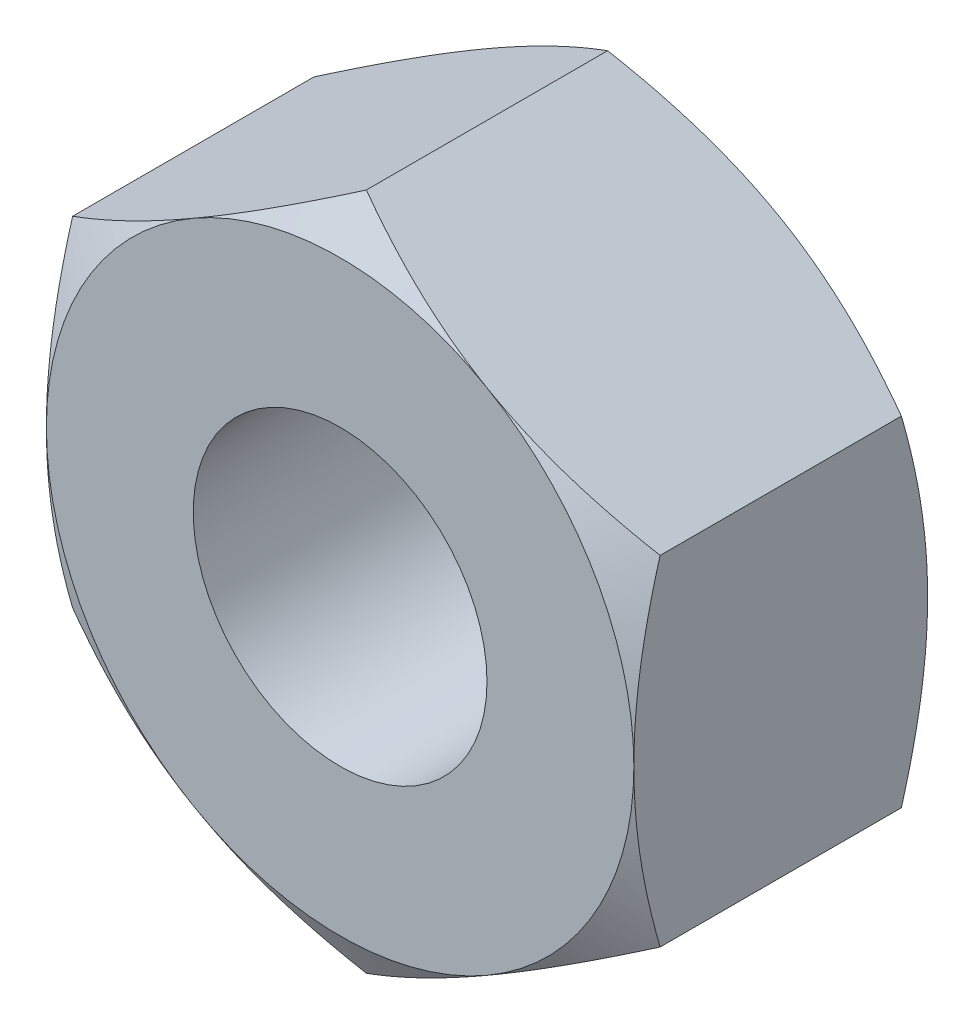
ISO-10303-21;
HEADER;
FILE_DESCRIPTION(('STEP AP214'),'2;1');
FILE_NAME('part.step','',(''),(''),'','','');
FILE_SCHEMA(('AUTOMOTIVE_DESIGN { 1 0 10303 214 1 1 1 1 }'));
ENDSEC;
DATA;
#1=APPLICATION_CONTEXT('core data for automotive mechanical design processes');
#2=APPLICATION_PROTOCOL_DEFINITION('international standard','automotive_design',2000,#1);
#3=PRODUCT_CONTEXT('',#1,'mechanical');
#4=PRODUCT('Part','Part','',(#3));
#5=PRODUCT_RELATED_PRODUCT_CATEGORY('part','',(#4));
#6=PRODUCT_DEFINITION_FORMATION('','',#4);
#7=PRODUCT_DEFINITION_CONTEXT('part definition',#1,'design');
#8=PRODUCT_DEFINITION('design','',#6,#7);
#9=PRODUCT_DEFINITION_SHAPE('','',#8);
#10=(LENGTH_UNIT() NAMED_UNIT(*) SI_UNIT(.MILLI.,.METRE.));
#11=(NAMED_UNIT(*) PLANE_ANGLE_UNIT() SI_UNIT($,.RADIAN.));
#12=(NAMED_UNIT(*) SI_UNIT($,.STERADIAN.) SOLID_ANGLE_UNIT());
#13=UNCERTAINTY_MEASURE_WITH_UNIT(LENGTH_MEASURE(1.E-05),#10,'distance_accuracy_value','');
#14=(GEOMETRIC_REPRESENTATION_CONTEXT(3) GLOBAL_UNCERTAINTY_ASSIGNED_CONTEXT((#13)) GLOBAL_UNIT_ASSIGNED_CONTEXT((#10,
#11,#12)) REPRESENTATION_CONTEXT('',''));
#15=CARTESIAN_POINT('',(0.,0.,0.));
#16=DIRECTION('',(0.,0.,1.));
#17=DIRECTION('',(1.,0.,0.));
#18=AXIS2_PLACEMENT_3D('',#15,#16,#17);
#19=CARTESIAN_POINT('',(0.,2.30940107675851,-2.));
#20=DIRECTION('',(-0.500000000000002,0.866025403784438,0.));
#21=DIRECTION('',(-0.866025403784438,-0.500000000000002,0.));
#22=AXIS2_PLACEMENT_3D('',#19,#20,#21);
#23=PLANE('',#22);
#24=DIRECTION('',(0.,0.,1.));
#25=VECTOR('',#24,1.);
#26=CARTESIAN_POINT('',(-2.,1.15470053837925,-2.));
#27=LINE('',#26,#25);
#28=CARTESIAN_POINT('',(-2.,1.15470053837926,-1.82136720504592));
#29=VERTEX_POINT('',#28);
#30=CARTESIAN_POINT('',(-2.,1.15470053837925,-0.178632794954081));
#31=VERTEX_POINT('',#30);
#32=EDGE_CURVE('E166',#29,#31,#27,.T.);
#33=ORIENTED_EDGE('',*,*,#32,.T.);
#34=CARTESIAN_POINT('',(-2.0002,1.15458506832541,-0.178699466620498));
#35=CARTESIAN_POINT('',(-1.91230873709994,1.20532911262018,-0.149389536100679));
#36=CARTESIAN_POINT('',(-1.82365880552641,1.2565111744778,-0.122732851980466));
#37=CARTESIAN_POINT('',(-1.6448237530022,1.35976164019319,-0.0762024910207205));
#38=CARTESIAN_POINT('',(-1.55463545349496,1.41183187919145,-0.0563452763827787));
#39=CARTESIAN_POINT('',(-1.37537661423669,1.51532701829183,-0.0254334640232521));
#40=CARTESIAN_POINT('',(-1.2863336617737,1.56673599086578,-0.0141731515985308));
#41=CARTESIAN_POINT('',(-1.10782860221496,1.66979593505373,-0.000728662594641722));
#42=CARTESIAN_POINT('',(-1.01836714429604,1.72144653186531,0.00146664504653192));
#43=CARTESIAN_POINT('',(-0.851191646451203,1.81796535054794,-0.00309098933064872));
#44=CARTESIAN_POINT('',(-0.773452629734217,1.86284799277603,-0.00872487468701454));
#45=CARTESIAN_POINT('',(-0.618481085463868,1.95232085557725,-0.0265838952608286));
#46=CARTESIAN_POINT('',(-0.541249094258803,1.99691076648954,-0.0388151360234399));
#47=CARTESIAN_POINT('',(-0.3859578135178,2.08656822922816,-0.0693934368676109));
#48=CARTESIAN_POINT('',(-0.307918186892621,2.13162442866767,-0.0878701670657172));
#49=CARTESIAN_POINT('',(-0.153003134307866,2.221064675979,-0.129805518212858));
#50=CARTESIAN_POINT('',(-0.0761257223768807,2.26544987045196,-0.153254280492315));
#51=CARTESIAN_POINT('',(0.000199999999999366,2.30951654681234,-0.1786994666205));
#52=B_SPLINE_CURVE_WITH_KNOTS('',3,(#34,#35,#36,#37,#38,#39,#40,#41,#42,#43,#44,#45,#46,#47,#48,
#49,#50,#51),.UNSPECIFIED.,.F.,.F.,(4,2,2,2,2,2,2,2,4),(0.,0.31703182469561,0.634825876346564,
0.944753967652636,1.25430138000371,1.52387047293094,1.79368946861028,2.06949491027634,
2.34475850821473),.UNSPECIFIED.);
#53=CARTESIAN_POINT('',(-1.,1.73205080756888,0.));
#54=VERTEX_POINT('',#53);
#55=EDGE_CURVE('E62',#31,#54,#52,.T.);
#56=ORIENTED_EDGE('',*,*,#55,.T.);
#57=CARTESIAN_POINT('',(0.,2.30940107675851,-0.178632794954083));
#58=VERTEX_POINT('',#57);
#59=EDGE_CURVE('E208',#54,#58,#52,.T.);
#60=ORIENTED_EDGE('',*,*,#59,.T.);
#61=DIRECTION('',(0.,0.,1.));
#62=VECTOR('',#61,1.);
#63=CARTESIAN_POINT('',(0.,2.30940107675851,-2.));
#64=LINE('',#63,#62);
#65=CARTESIAN_POINT('',(0.,2.30940107675851,-1.82136720504592));
#66=VERTEX_POINT('',#65);
#67=EDGE_CURVE('E151',#66,#58,#64,.T.);
#68=ORIENTED_EDGE('',*,*,#67,.F.);
#69=CARTESIAN_POINT('',(-2.0002,1.15458506832541,-1.8213005333795));
#70=CARTESIAN_POINT('',(-1.91230873709994,1.20532911262018,-1.85061046389932));
#71=CARTESIAN_POINT('',(-1.82365880552641,1.2565111744778,-1.87726714801953));
#72=CARTESIAN_POINT('',(-1.6448237530022,1.35976164019319,-1.92379750897928));
#73=CARTESIAN_POINT('',(-1.55463545349496,1.41183187919145,-1.94365472361722));
#74=CARTESIAN_POINT('',(-1.37537661423669,1.51532701829183,-1.97456653597675));
#75=CARTESIAN_POINT('',(-1.2863336617737,1.56673599086578,-1.98582684840147));
#76=CARTESIAN_POINT('',(-1.10782860221496,1.66979593505373,-1.99927133740536));
#77=CARTESIAN_POINT('',(-1.01836714429604,1.72144653186531,-2.00146664504653));
#78=CARTESIAN_POINT('',(-0.851191646451203,1.81796535054794,-1.99690901066935));
#79=CARTESIAN_POINT('',(-0.773452629734217,1.86284799277603,-1.99127512531299));
#80=CARTESIAN_POINT('',(-0.618481085463868,1.95232085557725,-1.97341610473917));
#81=CARTESIAN_POINT('',(-0.541249094258802,1.99691076648954,-1.96118486397656));
#82=CARTESIAN_POINT('',(-0.3859578135178,2.08656822922816,-1.93060656313239));
#83=CARTESIAN_POINT('',(-0.307918186892621,2.13162442866767,-1.91212983293428));
#84=CARTESIAN_POINT('',(-0.153003134307866,2.221064675979,-1.87019448178714));
#85=CARTESIAN_POINT('',(-0.0761257223768806,2.26544987045196,-1.84674571950768));
#86=CARTESIAN_POINT('',(0.000199999999999419,2.30951654681234,-1.8213005333795));
#87=B_SPLINE_CURVE_WITH_KNOTS('',3,(#69,#70,#71,#72,#73,#74,#75,#76,#77,#78,#79,#80,#81,#82,#83,
#84,#85,#86),.UNSPECIFIED.,.F.,.F.,(4,2,2,2,2,2,2,2,4),(0.,0.31703182469561,0.634825876346564,
0.944753967652636,1.25430138000371,1.52387047293094,1.79368946861028,2.06949491027634,
2.34475850821473),.UNSPECIFIED.);
#88=CARTESIAN_POINT('',(-1.,1.73205080756888,-2.));
#89=VERTEX_POINT('',#88);
#90=EDGE_CURVE('E252',#89,#66,#87,.T.);
#91=ORIENTED_EDGE('',*,*,#90,.F.);
#92=EDGE_CURVE('E196',#29,#89,#87,.T.);
#93=ORIENTED_EDGE('',*,*,#92,.F.);
#94=EDGE_LOOP('',(#33,#56,#60,#68,#91,#93));
#95=FACE_BOUND('',#94,.T.);
#96=ADVANCED_FACE('F38',(#95),#23,.T.);
#97=CARTESIAN_POINT('',(2.,1.15470053837925,-2.));
#98=DIRECTION('',(0.500000000000001,0.866025403784438,0.));
#99=DIRECTION('',(-0.866025403784438,0.500000000000001,0.));
#100=AXIS2_PLACEMENT_3D('',#97,#98,#99);
#101=PLANE('',#100);
#102=ORIENTED_EDGE('',*,*,#67,.T.);
#103=CARTESIAN_POINT('',(-0.000200000000000468,2.30951654681234,-0.1786994666205));
#104=CARTESIAN_POINT('',(0.0876912629000596,2.25877250251758,-0.149389536100681));
#105=CARTESIAN_POINT('',(0.176341194473591,2.20759044065996,-0.122732851980468));
#106=CARTESIAN_POINT('',(0.355176246997802,2.10433997494456,-0.0762024910207223));
#107=CARTESIAN_POINT('',(0.445364546505036,2.05226973594631,-0.0563452763827801));
#108=CARTESIAN_POINT('',(0.624623385763306,1.94877459684592,-0.025433464023253));
#109=CARTESIAN_POINT('',(0.713666338226304,1.89736562427197,-0.0141731515985314));
#110=CARTESIAN_POINT('',(0.892171397785043,1.79430568008402,-0.000728662594641879));
#111=CARTESIAN_POINT('',(0.981632855703958,1.74265508327244,0.0014666450465319));
#112=CARTESIAN_POINT('',(1.1488083535488,1.64613626458981,-0.00309098933064864));
#113=CARTESIAN_POINT('',(1.22654737026578,1.60125362236172,-0.00872487468701444));
#114=CARTESIAN_POINT('',(1.38151891453613,1.51178075956051,-0.0265838952608283));
#115=CARTESIAN_POINT('',(1.4587509057412,1.46719084864821,-0.0388151360234394));
#116=CARTESIAN_POINT('',(1.6140421864822,1.37753338590959,-0.0693934368676099));
#117=CARTESIAN_POINT('',(1.69208181310738,1.33247718647009,-0.087870167065716));
#118=CARTESIAN_POINT('',(1.84699686569214,1.24303693915875,-0.129805518212856));
#119=CARTESIAN_POINT('',(1.92387427762312,1.1986517446858,-0.153254280492314));
#120=CARTESIAN_POINT('',(2.0002,1.15458506832541,-0.178699466620498));
#121=B_SPLINE_CURVE_WITH_KNOTS('',3,(#103,#104,#105,#106,#107,#108,#109,#110,#111,#112,#113,
#114,#115,#116,#117,#118,#119,#120),.UNSPECIFIED.,.F.,.F.,(4,2,2,2,2,2,2,2,4),(0.,
0.31703182469561,0.634825876346564,0.944753967652637,1.25430138000371,1.52387047293094,
1.79368946861029,2.06949491027634,2.34475850821473),.UNSPECIFIED.);
#122=CARTESIAN_POINT('',(1.,1.73205080756888,0.));
#123=VERTEX_POINT('',#122);
#124=EDGE_CURVE('E144',#58,#123,#121,.T.);
#125=ORIENTED_EDGE('',*,*,#124,.T.);
#126=CARTESIAN_POINT('',(2.,1.15470053837926,-0.178632794954083));
#127=VERTEX_POINT('',#126);
#128=EDGE_CURVE('E130',#123,#127,#121,.T.);
#129=ORIENTED_EDGE('',*,*,#128,.T.);
#130=DIRECTION('',(0.,0.,1.));
#131=VECTOR('',#130,1.);
#132=CARTESIAN_POINT('',(2.,1.15470053837925,-2.));
#133=LINE('',#132,#131);
#134=CARTESIAN_POINT('',(2.,1.15470053837926,-1.82136720504592));
#135=VERTEX_POINT('',#134);
#136=EDGE_CURVE('E143',#135,#127,#133,.T.);
#137=ORIENTED_EDGE('',*,*,#136,.F.);
#138=CARTESIAN_POINT('',(-0.000200000000000468,2.30951654681234,-1.8213005333795));
#139=CARTESIAN_POINT('',(0.0876912629000599,2.25877250251758,-1.85061046389932));
#140=CARTESIAN_POINT('',(0.176341194473591,2.20759044065996,-1.87726714801953));
#141=CARTESIAN_POINT('',(0.355176246997802,2.10433997494456,-1.92379750897928));
#142=CARTESIAN_POINT('',(0.445364546505036,2.05226973594631,-1.94365472361722));
#143=CARTESIAN_POINT('',(0.624623385763306,1.94877459684592,-1.97456653597675));
#144=CARTESIAN_POINT('',(0.713666338226304,1.89736562427197,-1.98582684840147));
#145=CARTESIAN_POINT('',(0.892171397785043,1.79430568008402,-1.99927133740536));
#146=CARTESIAN_POINT('',(0.981632855703958,1.74265508327244,-2.00146664504653));
#147=CARTESIAN_POINT('',(1.1488083535488,1.64613626458981,-1.99690901066935));
#148=CARTESIAN_POINT('',(1.22654737026578,1.60125362236172,-1.99127512531299));
#149=CARTESIAN_POINT('',(1.38151891453613,1.51178075956051,-1.97341610473917));
#150=CARTESIAN_POINT('',(1.4587509057412,1.46719084864821,-1.96118486397656));
#151=CARTESIAN_POINT('',(1.6140421864822,1.37753338590959,-1.93060656313239));
#152=CARTESIAN_POINT('',(1.69208181310738,1.33247718647009,-1.91212983293428));
#153=CARTESIAN_POINT('',(1.84699686569213,1.24303693915875,-1.87019448178714));
#154=CARTESIAN_POINT('',(1.92387427762312,1.1986517446858,-1.84674571950769));
#155=CARTESIAN_POINT('',(2.0002,1.15458506832541,-1.8213005333795));
#156=B_SPLINE_CURVE_WITH_KNOTS('',3,(#138,#139,#140,#141,#142,#143,#144,#145,#146,#147,#148,
#149,#150,#151,#152,#153,#154,#155),.UNSPECIFIED.,.F.,.F.,(4,2,2,2,2,2,2,2,4),(0.,
0.317031824695611,0.634825876346565,0.944753967652638,1.25430138000371,1.52387047293094,
1.79368946861029,2.06949491027634,2.34475850821473),.UNSPECIFIED.);
#157=CARTESIAN_POINT('',(1.,1.73205080756888,-2.));
#158=VERTEX_POINT('',#157);
#159=EDGE_CURVE('E253',#158,#135,#156,.T.);
#160=ORIENTED_EDGE('',*,*,#159,.F.);
#161=EDGE_CURVE('E259',#66,#158,#156,.T.);
#162=ORIENTED_EDGE('',*,*,#161,.F.);
#163=EDGE_LOOP('',(#102,#125,#129,#137,#160,#162));
#164=FACE_BOUND('',#163,.T.);
#165=ADVANCED_FACE('F141',(#164),#101,.T.);
#166=CARTESIAN_POINT('',(2.,1.15470053837925,-2.));
#167=DIRECTION('',(-1.,0.,0.));
#168=DIRECTION('',(0.,0.,1.));
#169=AXIS2_PLACEMENT_3D('',#166,#167,#168);
#170=PLANE('',#169);
#171=CARTESIAN_POINT('',(2.,-3.06243599497946,-0.957053410620321));
#172=CARTESIAN_POINT('',(2.,-2.97462468513202,-0.914618135332453));
#173=CARTESIAN_POINT('',(2.,-2.88660576044575,-0.872604701878199));
#174=CARTESIAN_POINT('',(2.,-2.71004042392047,-0.789662573424089));
#175=CARTESIAN_POINT('',(2.,-2.62149392396103,-0.748734066234633));
#176=CARTESIAN_POINT('',(2.,-2.44328285836994,-0.667987231477973));
#177=CARTESIAN_POINT('',(2.,-2.3536147942302,-0.628176597351501));
#178=CARTESIAN_POINT('',(2.,-2.17354167395292,-0.550265292890161));
#179=CARTESIAN_POINT('',(2.,-2.08313665652235,-0.512164533422732));
#180=CARTESIAN_POINT('',(2.,-1.90031404940485,-0.437671460362099));
#181=CARTESIAN_POINT('',(2.,-1.80788540023434,-0.401306140224328));
#182=CARTESIAN_POINT('',(2.,-1.62195694964761,-0.331431205515075));
#183=CARTESIAN_POINT('',(2.,-1.52845725096658,-0.297921319609402));
#184=CARTESIAN_POINT('',(2.,-1.34040158791134,-0.234645877627144));
#185=CARTESIAN_POINT('',(2.,-1.24584820361334,-0.204872731943686));
#186=CARTESIAN_POINT('',(2.,-1.05539728812543,-0.150041663725098));
#187=CARTESIAN_POINT('',(2.,-0.959500192348565,-0.124982250068512));
#188=CARTESIAN_POINT('',(2.,-0.766296107056177,-0.0807954522614516));
#189=CARTESIAN_POINT('',(2.,-0.668988749343054,-0.0616696475902392));
#190=CARTESIAN_POINT('',(2.,-0.473201573751662,-0.0306369133490218));
#191=CARTESIAN_POINT('',(2.,-0.374721754836868,-0.0187299901614154));
#192=CARTESIAN_POINT('',(2.,-0.177725213014459,-0.00319166535968506));
#193=CARTESIAN_POINT('',(2.,-0.0792127464695957,0.000492126942978651));
#194=CARTESIAN_POINT('',(2.,0.117733134481544,-0.000599210482845615));
#195=CARTESIAN_POINT('',(2.,0.216166562771042,-0.00537214444611018));
#196=CARTESIAN_POINT('',(2.,0.454297223248123,-0.0267243139120264));
#197=CARTESIAN_POINT('',(2.,0.593620477818537,-0.0474829418890642));
#198=CARTESIAN_POINT('',(2.,0.869689306254771,-0.102199494270679));
#199=CARTESIAN_POINT('',(2.,1.00643164818022,-0.136172948124203));
#200=CARTESIAN_POINT('',(2.,1.21108706615394,-0.194758945655361));
#201=CARTESIAN_POINT('',(2.,1.28004655189501,-0.215857177032566));
#202=CARTESIAN_POINT('',(2.,1.41724192464572,-0.260142084128328));
#203=CARTESIAN_POINT('',(2.,1.48547827495748,-0.283327319381157));
#204=CARTESIAN_POINT('',(2.,1.62094688255353,-0.331302907971969));
#205=CARTESIAN_POINT('',(2.,1.68818262968755,-0.356083492073602));
#206=CARTESIAN_POINT('',(2.,1.82213246587634,-0.407099147686616));
#207=CARTESIAN_POINT('',(2.,1.88884633148565,-0.433334807052327));
#208=CARTESIAN_POINT('',(2.,1.95531849493342,-0.460154503270896));
#209=B_SPLINE_CURVE_WITH_KNOTS('',3,(#171,#172,#173,#174,#175,#176,#177,#178,#179,#180,#181,
#182,#183,#184,#185,#186,#187,#188,#189,#190,#191,#192,#193,#194,#195,#196,#197,#198,#199,#200,
#201,#202,#203,#204,#205,#206,#207,#208),.UNSPECIFIED.,.F.,.F.,(4,2,2,2,2,2,2,2,2,2,2,2,2,2,2,2,
2,2,4),(0.,0.292585896266135,0.585222115299633,0.879532973229947,1.17382847142413,
1.47176772581358,1.76967863724007,2.06697432467463,2.36417580814398,2.66145633652585,
2.95873712774069,3.25411843045681,3.54942304948606,3.97114178181684,4.39335760296179,
4.60967655565109,4.82584733174413,5.04080135347749,5.25584285892498),.UNSPECIFIED.);
#210=CARTESIAN_POINT('',(2.,-1.15470053837926,-0.178632794954083));
#211=VERTEX_POINT('',#210);
#212=CARTESIAN_POINT('',(2.,0.,0.));
#213=VERTEX_POINT('',#212);
#214=EDGE_CURVE('E136',#211,#213,#209,.T.);
#215=ORIENTED_EDGE('',*,*,#214,.F.);
#216=DIRECTION('',(0.,0.,1.));
#217=VECTOR('',#216,1.);
#218=CARTESIAN_POINT('',(2.,-1.15470053837926,-2.));
#219=LINE('',#218,#217);
#220=CARTESIAN_POINT('',(2.,-1.15470053837926,-1.82136720504592));
#221=VERTEX_POINT('',#220);
#222=EDGE_CURVE('E152',#221,#211,#219,.T.);
#223=ORIENTED_EDGE('',*,*,#222,.F.);
#224=CARTESIAN_POINT('',(2.,-3.06243599497946,-1.04294658937968));
#225=CARTESIAN_POINT('',(2.,-2.97462468513202,-1.08538186466755));
#226=CARTESIAN_POINT('',(2.,-2.88660576044575,-1.1273952981218));
#227=CARTESIAN_POINT('',(2.,-2.71004042392047,-1.21033742657591));
#228=CARTESIAN_POINT('',(2.,-2.62149392396103,-1.25126593376537));
#229=CARTESIAN_POINT('',(2.,-2.44328285836993,-1.33201276852203));
#230=CARTESIAN_POINT('',(2.,-2.3536147942302,-1.3718234026485));
#231=CARTESIAN_POINT('',(2.,-2.17354167395292,-1.44973470710984));
#232=CARTESIAN_POINT('',(2.,-2.08313665652235,-1.48783546657727));
#233=CARTESIAN_POINT('',(2.,-1.90031404940485,-1.5623285396379));
#234=CARTESIAN_POINT('',(2.,-1.80788540023434,-1.59869385977567));
#235=CARTESIAN_POINT('',(2.,-1.62195694964761,-1.66856879448492));
#236=CARTESIAN_POINT('',(2.,-1.52845725096658,-1.7020786803906));
#237=CARTESIAN_POINT('',(2.,-1.34040158791134,-1.76535412237286));
#238=CARTESIAN_POINT('',(2.,-1.24584820361334,-1.79512726805631));
#239=CARTESIAN_POINT('',(2.,-1.05539728812543,-1.8499583362749));
#240=CARTESIAN_POINT('',(2.,-0.959500192348565,-1.87501774993149));
#241=CARTESIAN_POINT('',(2.,-0.766296107056177,-1.91920454773855));
#242=CARTESIAN_POINT('',(2.,-0.668988749343054,-1.93833035240976));
#243=CARTESIAN_POINT('',(2.,-0.473201573751662,-1.96936308665098));
#244=CARTESIAN_POINT('',(2.,-0.374721754836869,-1.98127000983858));
#245=CARTESIAN_POINT('',(2.,-0.177725213014459,-1.99680833464032));
#246=CARTESIAN_POINT('',(2.,-0.079212746469596,-2.00049212694298));
#247=CARTESIAN_POINT('',(2.,0.117733134481544,-1.99940078951715));
#248=CARTESIAN_POINT('',(2.,0.216166562771042,-1.99462785555389));
#249=CARTESIAN_POINT('',(2.,0.454297223248123,-1.97327568608797));
#250=CARTESIAN_POINT('',(2.,0.593620477818537,-1.95251705811094));
#251=CARTESIAN_POINT('',(2.,0.86968930625477,-1.89780050572932));
#252=CARTESIAN_POINT('',(2.,1.00643164818021,-1.8638270518758));
#253=CARTESIAN_POINT('',(2.,1.21108706615394,-1.80524105434464));
#254=CARTESIAN_POINT('',(2.,1.28004655189501,-1.78414282296743));
#255=CARTESIAN_POINT('',(2.,1.41724192464571,-1.73985791587167));
#256=CARTESIAN_POINT('',(2.,1.48547827495748,-1.71667268061884));
#257=CARTESIAN_POINT('',(2.,1.62094688255353,-1.66869709202803));
#258=CARTESIAN_POINT('',(2.,1.68818262968755,-1.6439165079264));
#259=CARTESIAN_POINT('',(2.,1.82213246587634,-1.59290085231338));
#260=CARTESIAN_POINT('',(2.,1.88884633148565,-1.56666519294767));
#261=CARTESIAN_POINT('',(2.,1.95531849493342,-1.5398454967291));
#262=B_SPLINE_CURVE_WITH_KNOTS('',3,(#224,#225,#226,#227,#228,#229,#230,#231,#232,#233,#234,
#235,#236,#237,#238,#239,#240,#241,#242,#243,#244,#245,#246,#247,#248,#249,#250,#251,#252,#253,
#254,#255,#256,#257,#258,#259,#260,#261),.UNSPECIFIED.,.F.,.F.,(4,2,2,2,2,2,2,2,2,2,2,2,2,2,2,2,
2,2,4),(0.,0.292585896266136,0.585222115299634,0.879532973229949,1.17382847142413,
1.47176772581358,1.76967863724007,2.06697432467463,2.36417580814398,2.66145633652585,
2.95873712774069,3.25411843045681,3.54942304948606,3.97114178181684,4.39335760296179,
4.60967655565109,4.82584733174413,5.04080135347749,5.25584285892498),.UNSPECIFIED.);
#263=CARTESIAN_POINT('',(2.,0.,-2.));
#264=VERTEX_POINT('',#263);
#265=EDGE_CURVE('E243',#221,#264,#262,.T.);
#266=ORIENTED_EDGE('',*,*,#265,.T.);
#267=EDGE_CURVE('E150',#264,#135,#262,.T.);
#268=ORIENTED_EDGE('',*,*,#267,.T.);
#269=ORIENTED_EDGE('',*,*,#136,.T.);
#270=EDGE_CURVE('E127',#213,#127,#209,.T.);
#271=ORIENTED_EDGE('',*,*,#270,.F.);
#272=EDGE_LOOP('',(#215,#223,#266,#268,#269,#271));
#273=FACE_BOUND('',#272,.T.);
#274=ADVANCED_FACE('F147',(#273),#170,.F.);
#275=CARTESIAN_POINT('',(0.,-2.30940107675851,-2.));
#276=DIRECTION('',(0.500000000000002,-0.866025403784438,0.));
#277=DIRECTION('',(0.866025403784438,0.500000000000002,0.));
#278=AXIS2_PLACEMENT_3D('',#275,#276,#277);
#279=PLANE('',#278);
#280=ORIENTED_EDGE('',*,*,#222,.T.);
#281=CARTESIAN_POINT('',(2.0002,-1.15458506832542,-0.1786994666205));
#282=CARTESIAN_POINT('',(1.91230873709994,-1.20532911262018,-0.149389536100681));
#283=CARTESIAN_POINT('',(1.82365880552641,-1.2565111744778,-0.122732851980469));
#284=CARTESIAN_POINT('',(1.6448237530022,-1.3597616401932,-0.0762024910207234));
#285=CARTESIAN_POINT('',(1.55463545349496,-1.41183187919146,-0.0563452763827815));
#286=CARTESIAN_POINT('',(1.37537661423669,-1.51532701829184,-0.0254334640232552));
#287=CARTESIAN_POINT('',(1.2863336617737,-1.56673599086579,-0.0141731515985341));
#288=CARTESIAN_POINT('',(1.10782860221496,-1.66979593505374,-0.000728662594645445));
#289=CARTESIAN_POINT('',(1.01836714429604,-1.72144653186532,0.00146664504652793));
#290=CARTESIAN_POINT('',(0.851191646451202,-1.81796535054795,-0.00309098933065309));
#291=CARTESIAN_POINT('',(0.773452629734216,-1.86284799277604,-0.00872487468701901));
#292=CARTESIAN_POINT('',(0.618481085463866,-1.95232085557726,-0.0265838952608333));
#293=CARTESIAN_POINT('',(0.541249094258801,-1.99691076648955,-0.0388151360234447));
#294=CARTESIAN_POINT('',(0.385957813517799,-2.08656822922817,-0.0693934368676156));
#295=CARTESIAN_POINT('',(0.307918186892621,-2.13162442866768,-0.0878701670657219));
#296=CARTESIAN_POINT('',(0.153003134307865,-2.22106467597901,-0.129805518212862));
#297=CARTESIAN_POINT('',(0.07612572237688,-2.26544987045197,-0.15325428049232));
#298=CARTESIAN_POINT('',(-0.000199999999999941,-2.30951654681235,-0.178699466620505));
#299=B_SPLINE_CURVE_WITH_KNOTS('',3,(#281,#282,#283,#284,#285,#286,#287,#288,#289,#290,#291,
#292,#293,#294,#295,#296,#297,#298),.UNSPECIFIED.,.F.,.F.,(4,2,2,2,2,2,2,2,4),(0.,
0.317031824695611,0.634825876346564,0.944753967652637,1.25430138000371,1.52387047293094,
1.79368946861028,2.06949491027634,2.34475850821473),.UNSPECIFIED.);
#300=CARTESIAN_POINT('',(1.,-1.73205080756888,0.));
#301=VERTEX_POINT('',#300);
#302=EDGE_CURVE('E277',#211,#301,#299,.T.);
#303=ORIENTED_EDGE('',*,*,#302,.T.);
#304=CARTESIAN_POINT('',(0.,-2.30940107675851,-0.178632794954083));
#305=VERTEX_POINT('',#304);
#306=EDGE_CURVE('E278',#301,#305,#299,.T.);
#307=ORIENTED_EDGE('',*,*,#306,.T.);
#308=DIRECTION('',(0.,0.,1.));
#309=VECTOR('',#308,1.);
#310=CARTESIAN_POINT('',(0.,-2.30940107675851,-2.));
#311=LINE('',#310,#309);
#312=CARTESIAN_POINT('',(0.,-2.30940107675851,-1.82136720504592));
#313=VERTEX_POINT('',#312);
#314=EDGE_CURVE('E157',#313,#305,#311,.T.);
#315=ORIENTED_EDGE('',*,*,#314,.F.);
#316=CARTESIAN_POINT('',(2.0002,-1.15458506832542,-1.8213005333795));
#317=CARTESIAN_POINT('',(1.91230873709994,-1.20532911262018,-1.85061046389932));
#318=CARTESIAN_POINT('',(1.82365880552641,-1.2565111744778,-1.87726714801953));
#319=CARTESIAN_POINT('',(1.6448237530022,-1.3597616401932,-1.92379750897928));
#320=CARTESIAN_POINT('',(1.55463545349496,-1.41183187919146,-1.94365472361722));
#321=CARTESIAN_POINT('',(1.37537661423669,-1.51532701829184,-1.97456653597674));
#322=CARTESIAN_POINT('',(1.2863336617737,-1.56673599086579,-1.98582684840147));
#323=CARTESIAN_POINT('',(1.10782860221496,-1.66979593505374,-1.99927133740536));
#324=CARTESIAN_POINT('',(1.01836714429604,-1.72144653186532,-2.00146664504653));
#325=CARTESIAN_POINT('',(0.851191646451201,-1.81796535054795,-1.99690901066935));
#326=CARTESIAN_POINT('',(0.773452629734216,-1.86284799277604,-1.99127512531298));
#327=CARTESIAN_POINT('',(0.618481085463866,-1.95232085557726,-1.97341610473917));
#328=CARTESIAN_POINT('',(0.541249094258801,-1.99691076648955,-1.96118486397656));
#329=CARTESIAN_POINT('',(0.385957813517799,-2.08656822922817,-1.93060656313238));
#330=CARTESIAN_POINT('',(0.30791818689262,-2.13162442866768,-1.91212983293428));
#331=CARTESIAN_POINT('',(0.153003134307865,-2.22106467597901,-1.87019448178714));
#332=CARTESIAN_POINT('',(0.0761257223768801,-2.26544987045197,-1.84674571950768));
#333=CARTESIAN_POINT('',(-0.000199999999999666,-2.30951654681235,-1.8213005333795));
#334=B_SPLINE_CURVE_WITH_KNOTS('',3,(#316,#317,#318,#319,#320,#321,#322,#323,#324,#325,#326,
#327,#328,#329,#330,#331,#332,#333),.UNSPECIFIED.,.F.,.F.,(4,2,2,2,2,2,2,2,4),(0.,
0.317031824695611,0.634825876346565,0.944753967652637,1.25430138000371,1.52387047293094,
1.79368946861029,2.06949491027634,2.34475850821473),.UNSPECIFIED.);
#335=CARTESIAN_POINT('',(1.,-1.73205080756888,-2.));
#336=VERTEX_POINT('',#335);
#337=EDGE_CURVE('E237',#336,#313,#334,.T.);
#338=ORIENTED_EDGE('',*,*,#337,.F.);
#339=EDGE_CURVE('E318',#221,#336,#334,.T.);
#340=ORIENTED_EDGE('',*,*,#339,.F.);
#341=EDGE_LOOP('',(#280,#303,#307,#315,#338,#340));
#342=FACE_BOUND('',#341,.T.);
#343=ADVANCED_FACE('F290',(#342),#279,.T.);
#344=CARTESIAN_POINT('',(-2.,-1.15470053837926,-2.));
#345=DIRECTION('',(-0.500000000000001,-0.866025403784438,0.));
#346=DIRECTION('',(0.866025403784438,-0.500000000000001,0.));
#347=AXIS2_PLACEMENT_3D('',#344,#345,#346);
#348=PLANE('',#347);
#349=ORIENTED_EDGE('',*,*,#314,.T.);
#350=CARTESIAN_POINT('',(0.000200000000000258,-2.30951654681235,-0.178699466620504));
#351=CARTESIAN_POINT('',(-0.0876912629000602,-2.25877250251759,-0.149389536100685));
#352=CARTESIAN_POINT('',(-0.176341194473592,-2.20759044065996,-0.122732851980473));
#353=CARTESIAN_POINT('',(-0.355176246997803,-2.10433997494457,-0.0762024910207265));
#354=CARTESIAN_POINT('',(-0.445364546505038,-2.05226973594631,-0.0563452763827843));
#355=CARTESIAN_POINT('',(-0.624623385763308,-1.94877459684593,-0.0254334640232572));
#356=CARTESIAN_POINT('',(-0.713666338226307,-1.89736562427198,-0.0141731515985357));
#357=CARTESIAN_POINT('',(-0.892171397785046,-1.79430568008403,-0.000728662594646035));
#358=CARTESIAN_POINT('',(-0.981632855703962,-1.74265508327245,0.0014666450465279));
#359=CARTESIAN_POINT('',(-1.1488083535488,-1.64613626458982,-0.00309098933065252));
#360=CARTESIAN_POINT('',(-1.22654737026579,-1.60125362236173,-0.00872487468701829));
#361=CARTESIAN_POINT('',(-1.38151891453614,-1.51178075956051,-0.0265838952608321));
#362=CARTESIAN_POINT('',(-1.4587509057412,-1.46719084864822,-0.0388151360234431));
#363=CARTESIAN_POINT('',(-1.6140421864822,-1.3775333859096,-0.0693934368676132));
#364=CARTESIAN_POINT('',(-1.69208181310738,-1.33247718647009,-0.0878701670657189));
#365=CARTESIAN_POINT('',(-1.84699686569214,-1.24303693915876,-0.129805518212858));
#366=CARTESIAN_POINT('',(-1.92387427762312,-1.1986517446858,-0.153254280492316));
#367=CARTESIAN_POINT('',(-2.0002,-1.15458506832542,-0.1786994666205));
#368=B_SPLINE_CURVE_WITH_KNOTS('',3,(#350,#351,#352,#353,#354,#355,#356,#357,#358,#359,#360,
#361,#362,#363,#364,#365,#366,#367),.UNSPECIFIED.,.F.,.F.,(4,2,2,2,2,2,2,2,4),(0.,
0.317031824695611,0.634825876346567,0.944753967652641,1.25430138000372,1.52387047293094,
1.79368946861029,2.06949491027634,2.34475850821473),.UNSPECIFIED.);
#369=CARTESIAN_POINT('',(-1.,-1.73205080756888,0.));
#370=VERTEX_POINT('',#369);
#371=EDGE_CURVE('E284',#305,#370,#368,.T.);
#372=ORIENTED_EDGE('',*,*,#371,.T.);
#373=CARTESIAN_POINT('',(-2.,-1.15470053837926,-0.178632794954083));
#374=VERTEX_POINT('',#373);
#375=EDGE_CURVE('E285',#370,#374,#368,.T.);
#376=ORIENTED_EDGE('',*,*,#375,.T.);
#377=DIRECTION('',(0.,0.,1.));
#378=VECTOR('',#377,1.);
#379=CARTESIAN_POINT('',(-2.,-1.15470053837926,-2.));
#380=LINE('',#379,#378);
#381=CARTESIAN_POINT('',(-2.,-1.15470053837926,-1.82136720504592));
#382=VERTEX_POINT('',#381);
#383=EDGE_CURVE('E163',#382,#374,#380,.T.);
#384=ORIENTED_EDGE('',*,*,#383,.F.);
#385=CARTESIAN_POINT('',(0.00020000000000025,-2.30951654681235,-1.8213005333795));
#386=CARTESIAN_POINT('',(-0.0876912629000602,-2.25877250251758,-1.85061046389931));
#387=CARTESIAN_POINT('',(-0.176341194473592,-2.20759044065996,-1.87726714801953));
#388=CARTESIAN_POINT('',(-0.355176246997803,-2.10433997494457,-1.92379750897927));
#389=CARTESIAN_POINT('',(-0.445364546505038,-2.05226973594631,-1.94365472361722));
#390=CARTESIAN_POINT('',(-0.624623385763308,-1.94877459684593,-1.97456653597674));
#391=CARTESIAN_POINT('',(-0.713666338226307,-1.89736562427198,-1.98582684840146));
#392=CARTESIAN_POINT('',(-0.892171397785046,-1.79430568008403,-1.99927133740535));
#393=CARTESIAN_POINT('',(-0.981632855703962,-1.74265508327245,-2.00146664504653));
#394=CARTESIAN_POINT('',(-1.1488083535488,-1.64613626458982,-1.99690901066935));
#395=CARTESIAN_POINT('',(-1.22654737026579,-1.60125362236173,-1.99127512531298));
#396=CARTESIAN_POINT('',(-1.38151891453614,-1.51178075956051,-1.97341610473917));
#397=CARTESIAN_POINT('',(-1.4587509057412,-1.46719084864822,-1.96118486397656));
#398=CARTESIAN_POINT('',(-1.6140421864822,-1.3775333859096,-1.93060656313239));
#399=CARTESIAN_POINT('',(-1.69208181310738,-1.33247718647009,-1.91212983293428));
#400=CARTESIAN_POINT('',(-1.84699686569214,-1.24303693915876,-1.87019448178714));
#401=CARTESIAN_POINT('',(-1.92387427762312,-1.1986517446858,-1.84674571950768));
#402=CARTESIAN_POINT('',(-2.0002,-1.15458506832542,-1.8213005333795));
#403=B_SPLINE_CURVE_WITH_KNOTS('',3,(#385,#386,#387,#388,#389,#390,#391,#392,#393,#394,#395,
#396,#397,#398,#399,#400,#401,#402),.UNSPECIFIED.,.F.,.F.,(4,2,2,2,2,2,2,2,4),(0.,
0.317031824695612,0.634825876346567,0.944753967652641,1.25430138000372,1.52387047293094,
1.79368946861029,2.06949491027634,2.34475850821473),.UNSPECIFIED.);
#404=CARTESIAN_POINT('',(-1.,-1.73205080756888,-2.));
#405=VERTEX_POINT('',#404);
#406=EDGE_CURVE('E200',#405,#382,#403,.T.);
#407=ORIENTED_EDGE('',*,*,#406,.F.);
#408=EDGE_CURVE('E319',#313,#405,#403,.T.);
#409=ORIENTED_EDGE('',*,*,#408,.F.);
#410=EDGE_LOOP('',(#349,#372,#376,#384,#407,#409));
#411=FACE_BOUND('',#410,.T.);
#412=ADVANCED_FACE('F293',(#411),#348,.T.);
#413=CARTESIAN_POINT('',(-2.,1.15470053837925,-2.));
#414=DIRECTION('',(-1.,0.,0.));
#415=DIRECTION('',(0.,0.,1.));
#416=AXIS2_PLACEMENT_3D('',#413,#414,#415);
#417=PLANE('',#416);
#418=ORIENTED_EDGE('',*,*,#383,.T.);
#419=CARTESIAN_POINT('',(-2.,-3.06243599497946,-0.957053410620322));
#420=CARTESIAN_POINT('',(-2.,-2.97462468513202,-0.914618135332453));
#421=CARTESIAN_POINT('',(-2.,-2.88660576044575,-0.872604701878199));
#422=CARTESIAN_POINT('',(-2.,-2.71004042392047,-0.789662573424089));
#423=CARTESIAN_POINT('',(-2.,-2.62149392396103,-0.748734066234633));
#424=CARTESIAN_POINT('',(-2.,-2.44328285836993,-0.667987231477972));
#425=CARTESIAN_POINT('',(-2.,-2.3536147942302,-0.6281765973515));
#426=CARTESIAN_POINT('',(-2.,-2.17354167395292,-0.55026529289016));
#427=CARTESIAN_POINT('',(-2.,-2.08313665652235,-0.512164533422731));
#428=CARTESIAN_POINT('',(-2.,-1.90031404940485,-0.437671460362099));
#429=CARTESIAN_POINT('',(-2.,-1.80788540023434,-0.401306140224328));
#430=CARTESIAN_POINT('',(-2.,-1.62195694964761,-0.331431205515075));
#431=CARTESIAN_POINT('',(-2.,-1.52845725096658,-0.297921319609402));
#432=CARTESIAN_POINT('',(-2.,-1.34040158791134,-0.234645877627143));
#433=CARTESIAN_POINT('',(-2.,-1.24584820361334,-0.204872731943686));
#434=CARTESIAN_POINT('',(-2.,-1.05539728812543,-0.150041663725098));
#435=CARTESIAN_POINT('',(-2.,-0.959500192348566,-0.124982250068513));
#436=CARTESIAN_POINT('',(-2.,-0.766296107056178,-0.0807954522614521));
#437=CARTESIAN_POINT('',(-2.,-0.668988749343055,-0.0616696475902396));
#438=CARTESIAN_POINT('',(-2.,-0.473201573751663,-0.030636913349022));
#439=CARTESIAN_POINT('',(-2.,-0.374721754836869,-0.0187299901614154));
#440=CARTESIAN_POINT('',(-2.,-0.17772521301446,-0.00319166535968503));
#441=CARTESIAN_POINT('',(-2.,-0.0792127464695969,0.000492126942978602));
#442=CARTESIAN_POINT('',(-2.,0.117733134481543,-0.000599210482845567));
#443=CARTESIAN_POINT('',(-2.,0.216166562771041,-0.00537214444610997));
#444=CARTESIAN_POINT('',(-2.,0.454297223248123,-0.0267243139120261));
#445=CARTESIAN_POINT('',(-2.,0.593620477818537,-0.047482941889064));
#446=CARTESIAN_POINT('',(-2.,0.869689306254771,-0.102199494270679));
#447=CARTESIAN_POINT('',(-2.,1.00643164818022,-0.136172948124203));
#448=CARTESIAN_POINT('',(-2.,1.21108706615394,-0.194758945655361));
#449=CARTESIAN_POINT('',(-2.,1.28004655189501,-0.215857177032566));
#450=CARTESIAN_POINT('',(-2.,1.41724192464572,-0.260142084128328));
#451=CARTESIAN_POINT('',(-2.,1.48547827495748,-0.283327319381157));
#452=CARTESIAN_POINT('',(-2.,1.62094688255353,-0.331302907971969));
#453=CARTESIAN_POINT('',(-2.,1.68818262968755,-0.356083492073602));
#454=CARTESIAN_POINT('',(-2.,1.82213246587634,-0.407099147686616));
#455=CARTESIAN_POINT('',(-2.,1.88884633148565,-0.433334807052327));
#456=CARTESIAN_POINT('',(-2.,1.95531849493342,-0.460154503270896));
#457=B_SPLINE_CURVE_WITH_KNOTS('',3,(#419,#420,#421,#422,#423,#424,#425,#426,#427,#428,#429,
#430,#431,#432,#433,#434,#435,#436,#437,#438,#439,#440,#441,#442,#443,#444,#445,#446,#447,#448,
#449,#450,#451,#452,#453,#454,#455,#456),.UNSPECIFIED.,.F.,.F.,(4,2,2,2,2,2,2,2,2,2,2,2,2,2,2,2,
2,2,4),(0.,0.292585896266136,0.585222115299635,0.87953297322995,1.17382847142414,
1.47176772581358,1.76967863724007,2.06697432467463,2.36417580814398,2.66145633652585,
2.95873712774069,3.25411843045681,3.54942304948606,3.97114178181684,4.39335760296179,
4.60967655565109,4.82584733174413,5.04080135347749,5.25584285892499),.UNSPECIFIED.);
#458=CARTESIAN_POINT('',(-2.,0.,0.));
#459=VERTEX_POINT('',#458);
#460=EDGE_CURVE('E338',#374,#459,#457,.T.);
#461=ORIENTED_EDGE('',*,*,#460,.T.);
#462=EDGE_CURVE('E339',#459,#31,#457,.T.);
#463=ORIENTED_EDGE('',*,*,#462,.T.);
#464=ORIENTED_EDGE('',*,*,#32,.F.);
#465=CARTESIAN_POINT('',(-2.,-3.06243599497946,-1.04294658937968));
#466=CARTESIAN_POINT('',(-2.,-2.97462468513202,-1.08538186466755));
#467=CARTESIAN_POINT('',(-2.,-2.88660576044575,-1.1273952981218));
#468=CARTESIAN_POINT('',(-2.,-2.71004042392047,-1.21033742657591));
#469=CARTESIAN_POINT('',(-2.,-2.62149392396103,-1.25126593376537));
#470=CARTESIAN_POINT('',(-2.,-2.44328285836994,-1.33201276852203));
#471=CARTESIAN_POINT('',(-2.,-2.3536147942302,-1.3718234026485));
#472=CARTESIAN_POINT('',(-2.,-2.17354167395292,-1.44973470710984));
#473=CARTESIAN_POINT('',(-2.,-2.08313665652235,-1.48783546657727));
#474=CARTESIAN_POINT('',(-2.,-1.90031404940485,-1.5623285396379));
#475=CARTESIAN_POINT('',(-2.,-1.80788540023434,-1.59869385977567));
#476=CARTESIAN_POINT('',(-2.,-1.62195694964761,-1.66856879448492));
#477=CARTESIAN_POINT('',(-2.,-1.52845725096658,-1.7020786803906));
#478=CARTESIAN_POINT('',(-2.,-1.34040158791134,-1.76535412237286));
#479=CARTESIAN_POINT('',(-2.,-1.24584820361334,-1.79512726805631));
#480=CARTESIAN_POINT('',(-2.,-1.05539728812543,-1.8499583362749));
#481=CARTESIAN_POINT('',(-2.,-0.959500192348566,-1.87501774993149));
#482=CARTESIAN_POINT('',(-2.,-0.766296107056178,-1.91920454773855));
#483=CARTESIAN_POINT('',(-2.,-0.668988749343055,-1.93833035240976));
#484=CARTESIAN_POINT('',(-2.,-0.473201573751663,-1.96936308665098));
#485=CARTESIAN_POINT('',(-2.,-0.374721754836869,-1.98127000983858));
#486=CARTESIAN_POINT('',(-2.,-0.17772521301446,-1.99680833464032));
#487=CARTESIAN_POINT('',(-2.,-0.0792127464695969,-2.00049212694298));
#488=CARTESIAN_POINT('',(-2.,0.117733134481543,-1.99940078951715));
#489=CARTESIAN_POINT('',(-2.,0.216166562771041,-1.99462785555389));
#490=CARTESIAN_POINT('',(-2.,0.454297223248122,-1.97327568608797));
#491=CARTESIAN_POINT('',(-2.,0.593620477818536,-1.95251705811094));
#492=CARTESIAN_POINT('',(-2.,0.869689306254769,-1.89780050572932));
#493=CARTESIAN_POINT('',(-2.,1.00643164818021,-1.8638270518758));
#494=CARTESIAN_POINT('',(-2.,1.21108706615394,-1.80524105434464));
#495=CARTESIAN_POINT('',(-2.,1.28004655189501,-1.78414282296743));
#496=CARTESIAN_POINT('',(-2.,1.41724192464571,-1.73985791587167));
#497=CARTESIAN_POINT('',(-2.,1.48547827495748,-1.71667268061884));
#498=CARTESIAN_POINT('',(-2.,1.62094688255353,-1.66869709202803));
#499=CARTESIAN_POINT('',(-2.,1.68818262968755,-1.6439165079264));
#500=CARTESIAN_POINT('',(-2.,1.82213246587634,-1.59290085231338));
#501=CARTESIAN_POINT('',(-2.,1.88884633148565,-1.56666519294767));
#502=CARTESIAN_POINT('',(-2.,1.95531849493342,-1.53984549672911));
#503=B_SPLINE_CURVE_WITH_KNOTS('',3,(#465,#466,#467,#468,#469,#470,#471,#472,#473,#474,#475,
#476,#477,#478,#479,#480,#481,#482,#483,#484,#485,#486,#487,#488,#489,#490,#491,#492,#493,#494,
#495,#496,#497,#498,#499,#500,#501,#502),.UNSPECIFIED.,.F.,.F.,(4,2,2,2,2,2,2,2,2,2,2,2,2,2,2,2,
2,2,4),(0.,0.292585896266136,0.585222115299634,0.87953297322995,1.17382847142414,
1.47176772581358,1.76967863724007,2.06697432467463,2.36417580814398,2.66145633652585,
2.95873712774069,3.25411843045681,3.54942304948606,3.97114178181684,4.39335760296179,
4.60967655565109,4.82584733174413,5.04080135347749,5.25584285892498),.UNSPECIFIED.);
#504=CARTESIAN_POINT('',(-2.,0.,-2.));
#505=VERTEX_POINT('',#504);
#506=EDGE_CURVE('E194',#505,#29,#503,.T.);
#507=ORIENTED_EDGE('',*,*,#506,.F.);
#508=EDGE_CURVE('E198',#382,#505,#503,.T.);
#509=ORIENTED_EDGE('',*,*,#508,.F.);
#510=EDGE_LOOP('',(#418,#461,#463,#464,#507,#509));
#511=FACE_BOUND('',#510,.T.);
#512=ADVANCED_FACE('F205',(#511),#417,.T.);
#513=CARTESIAN_POINT('',(-3.99999999999999,0.,0.));
#514=DIRECTION('',(0.,0.,1.));
#515=DIRECTION('',(1.,0.,0.));
#516=AXIS2_PLACEMENT_3D('',#513,#514,#515);
#517=PLANE('',#516);
#518=CARTESIAN_POINT('',(0.,0.,0.));
#519=DIRECTION('',(0.,0.,1.));
#520=DIRECTION('',(1.,0.,0.));
#521=AXIS2_PLACEMENT_3D('',#518,#519,#520);
#522=CIRCLE('',#521,1.);
#523=CARTESIAN_POINT('',(1.,0.,0.));
#524=VERTEX_POINT('',#523);
#525=EDGE_CURVE('E311',#524,#524,#522,.T.);
#526=ORIENTED_EDGE('',*,*,#525,.F.);
#527=EDGE_LOOP('',(#526));
#528=FACE_BOUND('',#527,.T.);
#529=CARTESIAN_POINT('',(0.,0.,0.));
#530=DIRECTION('',(0.,0.,1.));
#531=DIRECTION('',(1.,0.,0.));
#532=AXIS2_PLACEMENT_3D('',#529,#530,#531);
#533=CIRCLE('',#532,2.);
#534=EDGE_CURVE('E42',#301,#213,#533,.T.);
#535=ORIENTED_EDGE('',*,*,#534,.T.);
#536=CARTESIAN_POINT('',(0.,0.,0.));
#537=DIRECTION('',(0.,0.,1.));
#538=DIRECTION('',(1.,0.,0.));
#539=AXIS2_PLACEMENT_3D('',#536,#537,#538);
#540=CIRCLE('',#539,2.);
#541=EDGE_CURVE('E54',#213,#123,#540,.T.);
#542=ORIENTED_EDGE('',*,*,#541,.T.);
#543=EDGE_CURVE('E11',#123,#54,#533,.T.);
#544=ORIENTED_EDGE('',*,*,#543,.T.);
#545=EDGE_CURVE('E47',#54,#459,#533,.T.);
#546=ORIENTED_EDGE('',*,*,#545,.T.);
#547=EDGE_CURVE('E336',#459,#370,#533,.T.);
#548=ORIENTED_EDGE('',*,*,#547,.T.);
#549=EDGE_CURVE('E177',#370,#301,#533,.T.);
#550=ORIENTED_EDGE('',*,*,#549,.T.);
#551=EDGE_LOOP('',(#535,#542,#544,#546,#548,#550));
#552=FACE_BOUND('',#551,.T.);
#553=ADVANCED_FACE('F263',(#528,#552),#517,.T.);
#554=CARTESIAN_POINT('',(-3.99999999999999,0.,-2.));
#555=DIRECTION('',(0.,0.,1.));
#556=DIRECTION('',(1.,0.,0.));
#557=AXIS2_PLACEMENT_3D('',#554,#555,#556);
#558=PLANE('',#557);
#559=CARTESIAN_POINT('',(0.,0.,-2.));
#560=DIRECTION('',(0.,0.,1.));
#561=DIRECTION('',(1.,0.,0.));
#562=AXIS2_PLACEMENT_3D('',#559,#560,#561);
#563=CIRCLE('',#562,1.);
#564=CARTESIAN_POINT('',(1.,0.,-2.));
#565=VERTEX_POINT('',#564);
#566=EDGE_CURVE('E168',#565,#565,#563,.T.);
#567=ORIENTED_EDGE('',*,*,#566,.T.);
#568=EDGE_LOOP('',(#567));
#569=FACE_BOUND('',#568,.T.);
#570=CARTESIAN_POINT('',(0.,0.,-2.));
#571=DIRECTION('',(0.,0.,1.));
#572=DIRECTION('',(1.,0.,0.));
#573=AXIS2_PLACEMENT_3D('',#570,#571,#572);
#574=CIRCLE('',#573,2.);
#575=EDGE_CURVE('E206',#264,#158,#574,.T.);
#576=ORIENTED_EDGE('',*,*,#575,.F.);
#577=CARTESIAN_POINT('',(0.,0.,-2.));
#578=DIRECTION('',(0.,0.,1.));
#579=DIRECTION('',(1.,0.,0.));
#580=AXIS2_PLACEMENT_3D('',#577,#578,#579);
#581=CIRCLE('',#580,2.);
#582=EDGE_CURVE('E169',#264,#336,#581,.F.);
#583=ORIENTED_EDGE('',*,*,#582,.T.);
#584=EDGE_CURVE('E171',#336,#405,#581,.F.);
#585=ORIENTED_EDGE('',*,*,#584,.T.);
#586=EDGE_CURVE('E178',#405,#505,#581,.F.);
#587=ORIENTED_EDGE('',*,*,#586,.T.);
#588=EDGE_CURVE('E180',#505,#89,#581,.F.);
#589=ORIENTED_EDGE('',*,*,#588,.T.);
#590=EDGE_CURVE('E154',#89,#158,#581,.F.);
#591=ORIENTED_EDGE('',*,*,#590,.T.);
#592=EDGE_LOOP('',(#576,#583,#585,#587,#589,#591));
#593=FACE_BOUND('',#592,.T.);
#594=ADVANCED_FACE('F186',(#569,#593),#558,.F.);
#595=CARTESIAN_POINT('',(0.,0.,-2.));
#596=DIRECTION('',(0.,0.,1.));
#597=DIRECTION('',(1.,0.,0.));
#598=AXIS2_PLACEMENT_3D('',#595,#596,#597);
#599=CYLINDRICAL_SURFACE('',#598,1.);
#600=ORIENTED_EDGE('',*,*,#566,.F.);
#601=EDGE_LOOP('',(#600));
#602=FACE_BOUND('',#601,.T.);
#603=ORIENTED_EDGE('',*,*,#525,.T.);
#604=EDGE_LOOP('',(#603));
#605=FACE_BOUND('',#604,.T.);
#606=ADVANCED_FACE('F229',(#602,#605),#599,.F.);
#607=CARTESIAN_POINT('',(0.,0.,-2.));
#608=DIRECTION('',(0.,0.,1.));
#609=DIRECTION('',(1.,0.,0.));
#610=AXIS2_PLACEMENT_3D('',#607,#608,#609);
#611=CONICAL_SURFACE('',#610,2.,1.0471975511966);
#612=ORIENTED_EDGE('',*,*,#159,.T.);
#613=ORIENTED_EDGE('',*,*,#267,.F.);
#614=ORIENTED_EDGE('',*,*,#575,.T.);
#615=EDGE_LOOP('',(#612,#613,#614));
#616=FACE_BOUND('',#615,.T.);
#617=ADVANCED_FACE('F314',(#616),#611,.T.);
#618=ORIENTED_EDGE('',*,*,#90,.T.);
#619=ORIENTED_EDGE('',*,*,#161,.T.);
#620=ORIENTED_EDGE('',*,*,#590,.F.);
#621=EDGE_LOOP('',(#618,#619,#620));
#622=FACE_BOUND('',#621,.T.);
#623=ADVANCED_FACE('F226',(#622),#611,.T.);
#624=ORIENTED_EDGE('',*,*,#92,.T.);
#625=ORIENTED_EDGE('',*,*,#588,.F.);
#626=ORIENTED_EDGE('',*,*,#506,.T.);
#627=EDGE_LOOP('',(#624,#625,#626));
#628=FACE_BOUND('',#627,.T.);
#629=ADVANCED_FACE('F192',(#628),#611,.T.);
#630=ORIENTED_EDGE('',*,*,#406,.T.);
#631=ORIENTED_EDGE('',*,*,#508,.T.);
#632=ORIENTED_EDGE('',*,*,#586,.F.);
#633=EDGE_LOOP('',(#630,#631,#632));
#634=FACE_BOUND('',#633,.T.);
#635=ADVANCED_FACE('F199',(#634),#611,.T.);
#636=ORIENTED_EDGE('',*,*,#337,.T.);
#637=ORIENTED_EDGE('',*,*,#408,.T.);
#638=ORIENTED_EDGE('',*,*,#584,.F.);
#639=EDGE_LOOP('',(#636,#637,#638));
#640=FACE_BOUND('',#639,.T.);
#641=ADVANCED_FACE('F225',(#640),#611,.T.);
#642=ORIENTED_EDGE('',*,*,#339,.T.);
#643=ORIENTED_EDGE('',*,*,#582,.F.);
#644=ORIENTED_EDGE('',*,*,#265,.F.);
#645=EDGE_LOOP('',(#642,#643,#644));
#646=FACE_BOUND('',#645,.T.);
#647=ADVANCED_FACE('F361',(#646),#611,.T.);
#648=CARTESIAN_POINT('',(0.,0.,0.));
#649=DIRECTION('',(0.,0.,-1.));
#650=DIRECTION('',(-1.,0.,0.));
#651=AXIS2_PLACEMENT_3D('',#648,#649,#650);
#652=CONICAL_SURFACE('',#651,2.,1.0471975511966);
#653=ORIENTED_EDGE('',*,*,#214,.T.);
#654=ORIENTED_EDGE('',*,*,#534,.F.);
#655=ORIENTED_EDGE('',*,*,#302,.F.);
#656=EDGE_LOOP('',(#653,#654,#655));
#657=FACE_BOUND('',#656,.T.);
#658=ADVANCED_FACE('F332',(#657),#652,.T.);
#659=ORIENTED_EDGE('',*,*,#549,.F.);
#660=ORIENTED_EDGE('',*,*,#371,.F.);
#661=ORIENTED_EDGE('',*,*,#306,.F.);
#662=EDGE_LOOP('',(#659,#660,#661));
#663=FACE_BOUND('',#662,.T.);
#664=ADVANCED_FACE('F328',(#663),#652,.T.);
#665=ORIENTED_EDGE('',*,*,#547,.F.);
#666=ORIENTED_EDGE('',*,*,#460,.F.);
#667=ORIENTED_EDGE('',*,*,#375,.F.);
#668=EDGE_LOOP('',(#665,#666,#667));
#669=FACE_BOUND('',#668,.T.);
#670=ADVANCED_FACE('F227',(#669),#652,.T.);
#671=ORIENTED_EDGE('',*,*,#462,.F.);
#672=ORIENTED_EDGE('',*,*,#545,.F.);
#673=ORIENTED_EDGE('',*,*,#55,.F.);
#674=EDGE_LOOP('',(#671,#672,#673));
#675=FACE_BOUND('',#674,.T.);
#676=ADVANCED_FACE('F347',(#675),#652,.T.);
#677=ORIENTED_EDGE('',*,*,#543,.F.);
#678=ORIENTED_EDGE('',*,*,#124,.F.);
#679=ORIENTED_EDGE('',*,*,#59,.F.);
#680=EDGE_LOOP('',(#677,#678,#679));
#681=FACE_BOUND('',#680,.T.);
#682=ADVANCED_FACE('F348',(#681),#652,.T.);
#683=ORIENTED_EDGE('',*,*,#541,.F.);
#684=ORIENTED_EDGE('',*,*,#270,.T.);
#685=ORIENTED_EDGE('',*,*,#128,.F.);
#686=EDGE_LOOP('',(#683,#684,#685));
#687=FACE_BOUND('',#686,.T.);
#688=ADVANCED_FACE('F129',(#687),#652,.T.);
#689=CLOSED_SHELL('',(#96,#165,#274,#343,#412,#512,#553,#594,#606,#617,#623,#629,#635,#641,#647,
#658,#664,#670,#676,#682,#688));
#690=MANIFOLD_SOLID_BREP('B2',#689);
#691=ADVANCED_BREP_SHAPE_REPRESENTATION('',(#18,#690),#14);
#692=SHAPE_DEFINITION_REPRESENTATION(#9,#691);
ENDSEC;
END-ISO-10303-21;
